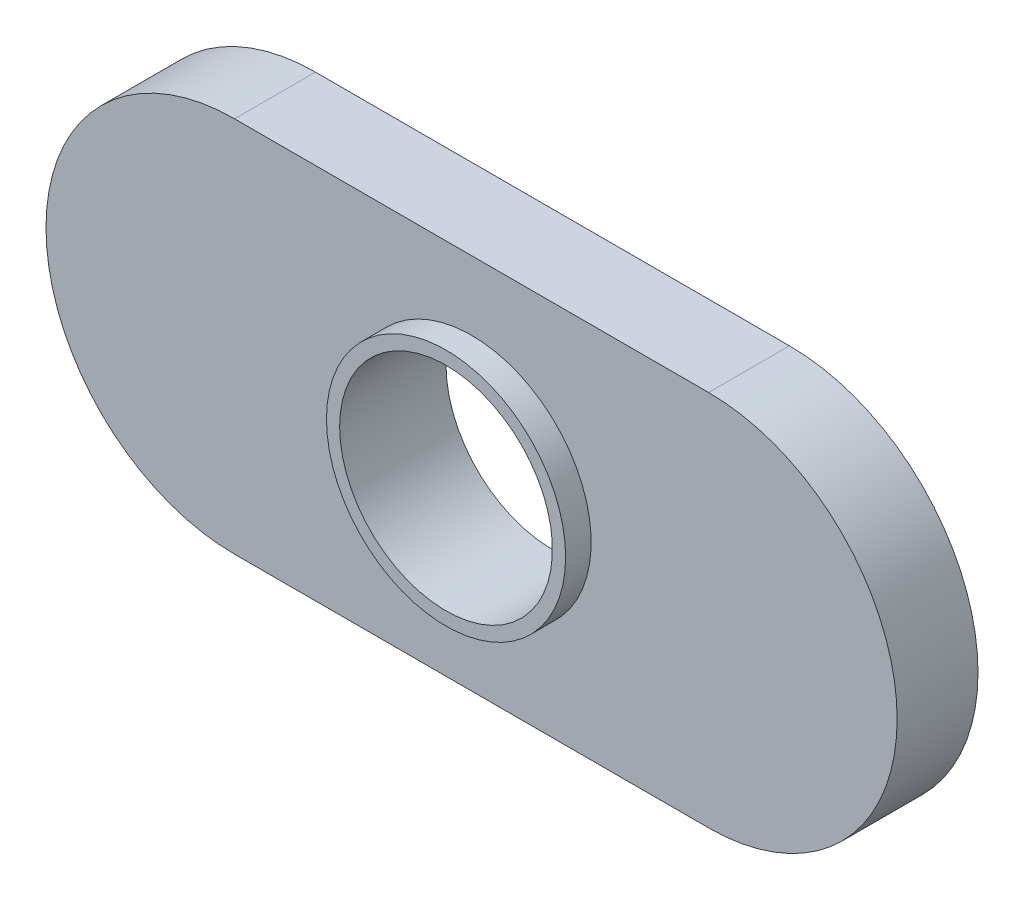
ISO-10303-21;
HEADER;
FILE_DESCRIPTION(('STEP AP214'),'2;1');
FILE_NAME('part.step','',(''),(''),'','','');
FILE_SCHEMA(('AUTOMOTIVE_DESIGN { 1 0 10303 214 1 1 1 1 }'));
ENDSEC;
DATA;
#1=APPLICATION_CONTEXT('core data for automotive mechanical design processes');
#2=APPLICATION_PROTOCOL_DEFINITION('international standard','automotive_design',2000,#1);
#3=PRODUCT_CONTEXT('',#1,'mechanical');
#4=PRODUCT('Part','Part','',(#3));
#5=PRODUCT_RELATED_PRODUCT_CATEGORY('part','',(#4));
#6=PRODUCT_DEFINITION_FORMATION('','',#4);
#7=PRODUCT_DEFINITION_CONTEXT('part definition',#1,'design');
#8=PRODUCT_DEFINITION('design','',#6,#7);
#9=PRODUCT_DEFINITION_SHAPE('','',#8);
#10=(LENGTH_UNIT() NAMED_UNIT(*) SI_UNIT(.MILLI.,.METRE.));
#11=(NAMED_UNIT(*) PLANE_ANGLE_UNIT() SI_UNIT($,.RADIAN.));
#12=(NAMED_UNIT(*) SI_UNIT($,.STERADIAN.) SOLID_ANGLE_UNIT());
#13=UNCERTAINTY_MEASURE_WITH_UNIT(LENGTH_MEASURE(1.E-05),#10,'distance_accuracy_value','');
#14=(GEOMETRIC_REPRESENTATION_CONTEXT(3) GLOBAL_UNCERTAINTY_ASSIGNED_CONTEXT((#13)) GLOBAL_UNIT_ASSIGNED_CONTEXT((#10,
#11,#12)) REPRESENTATION_CONTEXT('',''));
#15=CARTESIAN_POINT('',(0.,0.,0.));
#16=DIRECTION('',(0.,0.,1.));
#17=DIRECTION('',(1.,0.,0.));
#18=AXIS2_PLACEMENT_3D('',#15,#16,#17);
#19=CARTESIAN_POINT('',(111.278662660247,125.933065895994,2.413));
#20=DIRECTION('',(0.,0.,-1.));
#21=DIRECTION('',(-1.,0.,0.));
#22=AXIS2_PLACEMENT_3D('',#19,#20,#21);
#23=PLANE('',#22);
#24=CARTESIAN_POINT('',(111.278662660247,125.933065895994,2.413));
#25=DIRECTION('',(0.,0.,1.));
#26=DIRECTION('',(-1.,0.,0.));
#27=AXIS2_PLACEMENT_3D('',#24,#25,#26);
#28=CIRCLE('',#27,5.62609999999999);
#29=CARTESIAN_POINT('',(111.278662660247,131.559165895994,2.413));
#30=VERTEX_POINT('',#29);
#31=CARTESIAN_POINT('',(111.278662660247,120.306965895994,2.413));
#32=VERTEX_POINT('',#31);
#33=EDGE_CURVE('E86',#30,#32,#28,.T.);
#34=ORIENTED_EDGE('',*,*,#33,.T.);
#35=DIRECTION('',(1.,0.,0.));
#36=VECTOR('',#35,1.);
#37=CARTESIAN_POINT('',(111.278662660247,120.306965895994,2.413));
#38=LINE('',#37,#36);
#39=CARTESIAN_POINT('',(125.426462660247,120.306965895994,2.413));
#40=VERTEX_POINT('',#39);
#41=EDGE_CURVE('E81',#32,#40,#38,.T.);
#42=ORIENTED_EDGE('',*,*,#41,.T.);
#43=CARTESIAN_POINT('',(125.426462660247,125.933065895994,2.413));
#44=DIRECTION('',(0.,0.,1.));
#45=DIRECTION('',(1.,0.,0.));
#46=AXIS2_PLACEMENT_3D('',#43,#44,#45);
#47=CIRCLE('',#46,5.62609999999999);
#48=CARTESIAN_POINT('',(125.426462660247,131.559165895994,2.413));
#49=VERTEX_POINT('',#48);
#50=EDGE_CURVE('E84',#40,#49,#47,.T.);
#51=ORIENTED_EDGE('',*,*,#50,.T.);
#52=DIRECTION('',(-1.,0.,0.));
#53=VECTOR('',#52,1.);
#54=CARTESIAN_POINT('',(111.278662660247,131.559165895994,2.413));
#55=LINE('',#54,#53);
#56=EDGE_CURVE('E50',#49,#30,#55,.T.);
#57=ORIENTED_EDGE('',*,*,#56,.T.);
#58=EDGE_LOOP('',(#34,#42,#51,#57));
#59=FACE_BOUND('',#58,.T.);
#60=CARTESIAN_POINT('',(118.352562660247,125.933065895994,2.413));
#61=DIRECTION('',(0.,0.,-1.));
#62=DIRECTION('',(-1.,0.,0.));
#63=AXIS2_PLACEMENT_3D('',#60,#61,#62);
#64=CIRCLE('',#63,3.5687);
#65=CARTESIAN_POINT('',(114.783862660247,125.933065895994,2.413));
#66=VERTEX_POINT('',#65);
#67=EDGE_CURVE('E11',#66,#66,#64,.F.);
#68=ORIENTED_EDGE('',*,*,#67,.F.);
#69=EDGE_LOOP('',(#68));
#70=FACE_BOUND('',#69,.T.);
#71=ADVANCED_FACE('F33',(#59,#70),#23,.F.);
#72=CARTESIAN_POINT('',(111.278662660247,125.933065895994,2.413));
#73=DIRECTION('',(0.,0.,-1.));
#74=DIRECTION('',(-1.,0.,0.));
#75=AXIS2_PLACEMENT_3D('',#72,#73,#74);
#76=CYLINDRICAL_SURFACE('',#75,5.62609999999999);
#77=CARTESIAN_POINT('',(111.278662660247,125.933065895994,0.));
#78=DIRECTION('',(0.,0.,1.));
#79=DIRECTION('',(-1.,0.,0.));
#80=AXIS2_PLACEMENT_3D('',#77,#78,#79);
#81=CIRCLE('',#80,5.62609999999999);
#82=CARTESIAN_POINT('',(111.278662660247,131.559165895994,0.));
#83=VERTEX_POINT('',#82);
#84=CARTESIAN_POINT('',(111.278662660247,120.306965895994,0.));
#85=VERTEX_POINT('',#84);
#86=EDGE_CURVE('E100',#83,#85,#81,.T.);
#87=ORIENTED_EDGE('',*,*,#86,.T.);
#88=DIRECTION('',(0.,0.,-1.));
#89=VECTOR('',#88,1.);
#90=CARTESIAN_POINT('',(111.278662660247,120.306965895994,2.413));
#91=LINE('',#90,#89);
#92=EDGE_CURVE('E42',#32,#85,#91,.T.);
#93=ORIENTED_EDGE('',*,*,#92,.F.);
#94=ORIENTED_EDGE('',*,*,#33,.F.);
#95=DIRECTION('',(0.,0.,-1.));
#96=VECTOR('',#95,1.);
#97=CARTESIAN_POINT('',(111.278662660247,131.559165895994,2.413));
#98=LINE('',#97,#96);
#99=EDGE_CURVE('E96',#30,#83,#98,.T.);
#100=ORIENTED_EDGE('',*,*,#99,.T.);
#101=EDGE_LOOP('',(#87,#93,#94,#100));
#102=FACE_BOUND('',#101,.T.);
#103=ADVANCED_FACE('F35',(#102),#76,.T.);
#104=CARTESIAN_POINT('',(111.278662660247,120.306965895994,2.413));
#105=DIRECTION('',(0.,1.,0.));
#106=DIRECTION('',(0.,0.,1.));
#107=AXIS2_PLACEMENT_3D('',#104,#105,#106);
#108=PLANE('',#107);
#109=DIRECTION('',(1.,0.,0.));
#110=VECTOR('',#109,1.);
#111=CARTESIAN_POINT('',(111.278662660247,120.306965895994,0.));
#112=LINE('',#111,#110);
#113=CARTESIAN_POINT('',(125.426462660247,120.306965895994,0.));
#114=VERTEX_POINT('',#113);
#115=EDGE_CURVE('E91',#85,#114,#112,.T.);
#116=ORIENTED_EDGE('',*,*,#115,.T.);
#117=DIRECTION('',(0.,0.,-1.));
#118=VECTOR('',#117,1.);
#119=CARTESIAN_POINT('',(125.426462660247,120.306965895994,2.413));
#120=LINE('',#119,#118);
#121=EDGE_CURVE('E89',#40,#114,#120,.T.);
#122=ORIENTED_EDGE('',*,*,#121,.F.);
#123=ORIENTED_EDGE('',*,*,#41,.F.);
#124=ORIENTED_EDGE('',*,*,#92,.T.);
#125=EDGE_LOOP('',(#116,#122,#123,#124));
#126=FACE_BOUND('',#125,.T.);
#127=ADVANCED_FACE('F90',(#126),#108,.F.);
#128=CARTESIAN_POINT('',(125.426462660247,125.933065895994,2.413));
#129=DIRECTION('',(0.,0.,-1.));
#130=DIRECTION('',(-1.,0.,0.));
#131=AXIS2_PLACEMENT_3D('',#128,#129,#130);
#132=CYLINDRICAL_SURFACE('',#131,5.62609999999999);
#133=CARTESIAN_POINT('',(125.426462660247,125.933065895994,0.));
#134=DIRECTION('',(0.,0.,1.));
#135=DIRECTION('',(1.,0.,0.));
#136=AXIS2_PLACEMENT_3D('',#133,#134,#135);
#137=CIRCLE('',#136,5.62609999999999);
#138=CARTESIAN_POINT('',(125.426462660247,131.559165895994,0.));
#139=VERTEX_POINT('',#138);
#140=EDGE_CURVE('E67',#114,#139,#137,.T.);
#141=ORIENTED_EDGE('',*,*,#140,.T.);
#142=DIRECTION('',(0.,0.,-1.));
#143=VECTOR('',#142,1.);
#144=CARTESIAN_POINT('',(125.426462660247,131.559165895994,2.413));
#145=LINE('',#144,#143);
#146=EDGE_CURVE('E92',#49,#139,#145,.T.);
#147=ORIENTED_EDGE('',*,*,#146,.F.);
#148=ORIENTED_EDGE('',*,*,#50,.F.);
#149=ORIENTED_EDGE('',*,*,#121,.T.);
#150=EDGE_LOOP('',(#141,#147,#148,#149));
#151=FACE_BOUND('',#150,.T.);
#152=ADVANCED_FACE('F94',(#151),#132,.T.);
#153=CARTESIAN_POINT('',(111.278662660247,131.559165895994,2.413));
#154=DIRECTION('',(0.,-1.,0.));
#155=DIRECTION('',(0.,0.,-1.));
#156=AXIS2_PLACEMENT_3D('',#153,#154,#155);
#157=PLANE('',#156);
#158=DIRECTION('',(-1.,0.,0.));
#159=VECTOR('',#158,1.);
#160=CARTESIAN_POINT('',(111.278662660247,131.559165895994,0.));
#161=LINE('',#160,#159);
#162=EDGE_CURVE('E73',#139,#83,#161,.T.);
#163=ORIENTED_EDGE('',*,*,#162,.T.);
#164=ORIENTED_EDGE('',*,*,#99,.F.);
#165=ORIENTED_EDGE('',*,*,#56,.F.);
#166=ORIENTED_EDGE('',*,*,#146,.T.);
#167=EDGE_LOOP('',(#163,#164,#165,#166));
#168=FACE_BOUND('',#167,.T.);
#169=ADVANCED_FACE('F114',(#168),#157,.F.);
#170=CARTESIAN_POINT('',(111.278662660247,125.933065895994,0.));
#171=DIRECTION('',(0.,0.,-1.));
#172=DIRECTION('',(-1.,0.,0.));
#173=AXIS2_PLACEMENT_3D('',#170,#171,#172);
#174=PLANE('',#173);
#175=CARTESIAN_POINT('',(118.352562660247,125.933065895994,0.));
#176=DIRECTION('',(0.,0.,-1.));
#177=DIRECTION('',(-1.,0.,0.));
#178=AXIS2_PLACEMENT_3D('',#175,#176,#177);
#179=CIRCLE('',#178,3.175);
#180=CARTESIAN_POINT('',(115.177562660247,125.933065895994,0.));
#181=VERTEX_POINT('',#180);
#182=EDGE_CURVE('E145',#181,#181,#179,.T.);
#183=ORIENTED_EDGE('',*,*,#182,.F.);
#184=EDGE_LOOP('',(#183));
#185=FACE_BOUND('',#184,.T.);
#186=ORIENTED_EDGE('',*,*,#86,.F.);
#187=ORIENTED_EDGE('',*,*,#162,.F.);
#188=ORIENTED_EDGE('',*,*,#140,.F.);
#189=ORIENTED_EDGE('',*,*,#115,.F.);
#190=EDGE_LOOP('',(#186,#187,#188,#189));
#191=FACE_BOUND('',#190,.T.);
#192=ADVANCED_FACE('F111',(#185,#191),#174,.T.);
#193=CARTESIAN_POINT('',(118.352562660247,125.933065895994,3.175));
#194=DIRECTION('',(0.,0.,-1.));
#195=DIRECTION('',(-1.,0.,0.));
#196=AXIS2_PLACEMENT_3D('',#193,#194,#195);
#197=CYLINDRICAL_SURFACE('',#196,3.5687);
#198=CARTESIAN_POINT('',(118.352562660247,125.933065895994,3.175));
#199=DIRECTION('',(0.,0.,1.));
#200=DIRECTION('',(1.,0.,0.));
#201=AXIS2_PLACEMENT_3D('',#198,#199,#200);
#202=CIRCLE('',#201,3.5687);
#203=CARTESIAN_POINT('',(121.921262660247,125.933065895994,3.175));
#204=VERTEX_POINT('',#203);
#205=EDGE_CURVE('E103',#204,#204,#202,.T.);
#206=ORIENTED_EDGE('',*,*,#205,.F.);
#207=EDGE_LOOP('',(#206));
#208=FACE_BOUND('',#207,.T.);
#209=ORIENTED_EDGE('',*,*,#67,.T.);
#210=EDGE_LOOP('',(#209));
#211=FACE_BOUND('',#210,.T.);
#212=ADVANCED_FACE('F113',(#208,#211),#197,.T.);
#213=CARTESIAN_POINT('',(118.352562660247,125.933065895994,3.175));
#214=DIRECTION('',(0.,0.,1.));
#215=DIRECTION('',(1.,0.,0.));
#216=AXIS2_PLACEMENT_3D('',#213,#214,#215);
#217=PLANE('',#216);
#218=CARTESIAN_POINT('',(118.352562660247,125.933065895994,3.175));
#219=DIRECTION('',(0.,0.,-1.));
#220=DIRECTION('',(-1.,0.,0.));
#221=AXIS2_PLACEMENT_3D('',#218,#219,#220);
#222=CIRCLE('',#221,3.175);
#223=CARTESIAN_POINT('',(115.177562660247,125.933065895994,3.175));
#224=VERTEX_POINT('',#223);
#225=EDGE_CURVE('E143',#224,#224,#222,.T.);
#226=ORIENTED_EDGE('',*,*,#225,.T.);
#227=EDGE_LOOP('',(#226));
#228=FACE_BOUND('',#227,.T.);
#229=ORIENTED_EDGE('',*,*,#205,.T.);
#230=EDGE_LOOP('',(#229));
#231=FACE_BOUND('',#230,.T.);
#232=ADVANCED_FACE('F121',(#228,#231),#217,.T.);
#233=CARTESIAN_POINT('',(118.352562660247,125.933065895994,3.175));
#234=DIRECTION('',(0.,0.,-1.));
#235=DIRECTION('',(-1.,0.,0.));
#236=AXIS2_PLACEMENT_3D('',#233,#234,#235);
#237=CYLINDRICAL_SURFACE('',#236,3.175);
#238=ORIENTED_EDGE('',*,*,#225,.F.);
#239=EDGE_LOOP('',(#238));
#240=FACE_BOUND('',#239,.T.);
#241=ORIENTED_EDGE('',*,*,#182,.T.);
#242=EDGE_LOOP('',(#241));
#243=FACE_BOUND('',#242,.T.);
#244=ADVANCED_FACE('F134',(#240,#243),#237,.F.);
#245=CLOSED_SHELL('',(#71,#103,#127,#152,#169,#192,#212,#232,#244));
#246=MANIFOLD_SOLID_BREP('B2',#245);
#247=ADVANCED_BREP_SHAPE_REPRESENTATION('',(#18,#246),#14);
#248=SHAPE_DEFINITION_REPRESENTATION(#9,#247);
ENDSEC;
END-ISO-10303-21;
